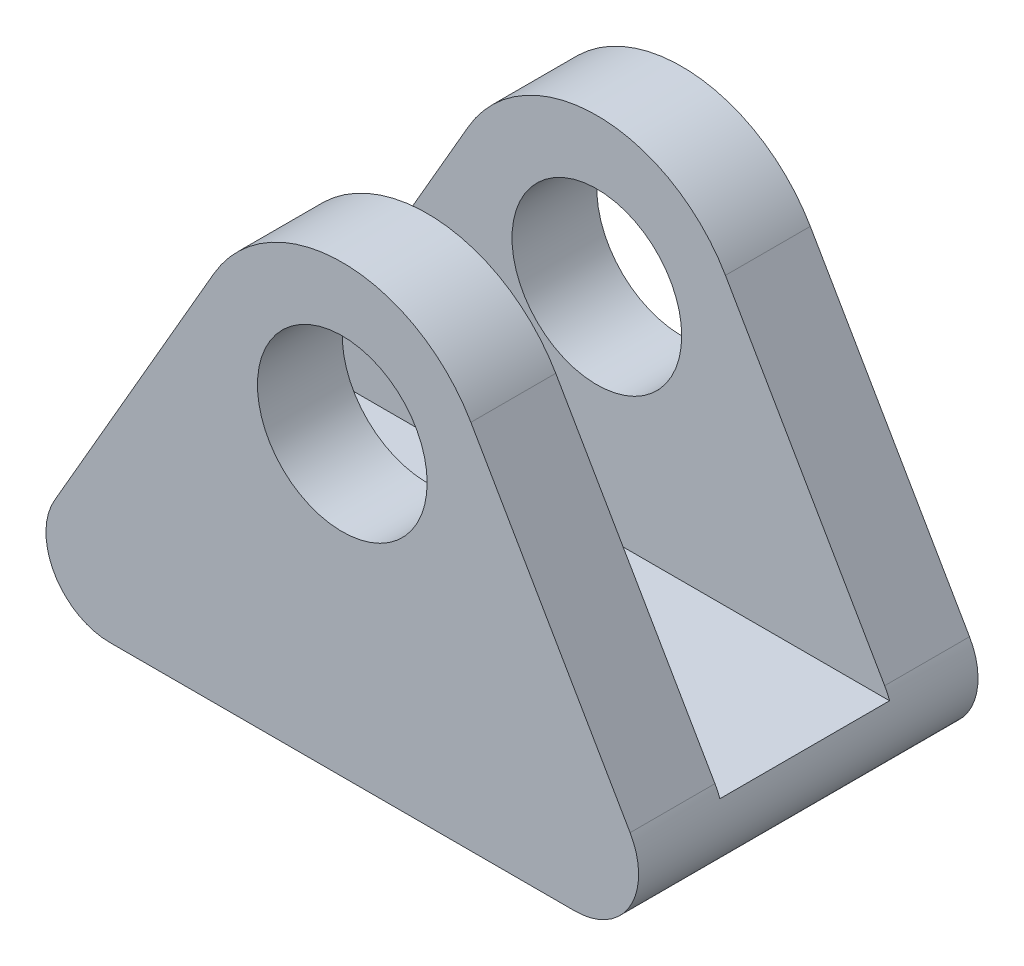
ISO-10303-21;
HEADER;
FILE_DESCRIPTION(('STEP AP214'),'2;1');
FILE_NAME('part.step','',(''),(''),'','','');
FILE_SCHEMA(('AUTOMOTIVE_DESIGN { 1 0 10303 214 1 1 1 1 }'));
ENDSEC;
DATA;
#1=APPLICATION_CONTEXT('core data for automotive mechanical design processes');
#2=APPLICATION_PROTOCOL_DEFINITION('international standard','automotive_design',2000,#1);
#3=PRODUCT_CONTEXT('',#1,'mechanical');
#4=PRODUCT('Part','Part','',(#3));
#5=PRODUCT_RELATED_PRODUCT_CATEGORY('part','',(#4));
#6=PRODUCT_DEFINITION_FORMATION('','',#4);
#7=PRODUCT_DEFINITION_CONTEXT('part definition',#1,'design');
#8=PRODUCT_DEFINITION('design','',#6,#7);
#9=PRODUCT_DEFINITION_SHAPE('','',#8);
#10=(LENGTH_UNIT() NAMED_UNIT(*) SI_UNIT(.MILLI.,.METRE.));
#11=(NAMED_UNIT(*) PLANE_ANGLE_UNIT() SI_UNIT($,.RADIAN.));
#12=(NAMED_UNIT(*) SI_UNIT($,.STERADIAN.) SOLID_ANGLE_UNIT());
#13=UNCERTAINTY_MEASURE_WITH_UNIT(LENGTH_MEASURE(1.E-05),#10,'distance_accuracy_value','');
#14=(GEOMETRIC_REPRESENTATION_CONTEXT(3) GLOBAL_UNCERTAINTY_ASSIGNED_CONTEXT((#13)) GLOBAL_UNIT_ASSIGNED_CONTEXT((#10,
#11,#12)) REPRESENTATION_CONTEXT('',''));
#15=CARTESIAN_POINT('',(0.,0.,0.));
#16=DIRECTION('',(0.,0.,1.));
#17=DIRECTION('',(1.,0.,0.));
#18=AXIS2_PLACEMENT_3D('',#15,#16,#17);
#19=CARTESIAN_POINT('',(16.1658075373096,-14.,4.));
#20=DIRECTION('',(-0.866025403784436,-0.500000000000004,0.));
#21=DIRECTION('',(0.500000000000004,-0.866025403784436,0.));
#22=AXIS2_PLACEMENT_3D('',#19,#20,#21);
#23=PLANE('',#22);
#24=DIRECTION('',(-0.500000000000004,0.866025403784436,0.));
#25=VECTOR('',#24,1.);
#26=CARTESIAN_POINT('',(16.1658075373096,-14.,4.));
#27=LINE('',#26,#25);
#28=CARTESIAN_POINT('',(13.5677313259563,-9.49999999999999,4.));
#29=VERTEX_POINT('',#28);
#30=CARTESIAN_POINT('',(6.06217782649106,3.50000000000003,4.));
#31=VERTEX_POINT('',#30);
#32=EDGE_CURVE('E192',#29,#31,#27,.T.);
#33=ORIENTED_EDGE('',*,*,#32,.F.);
#34=DIRECTION('',(0.,0.,-1.));
#35=VECTOR('',#34,1.);
#36=CARTESIAN_POINT('',(13.5677313259563,-9.49999999999999,4.));
#37=LINE('',#36,#35);
#38=CARTESIAN_POINT('',(13.5677313259563,-9.49999999999999,0.));
#39=VERTEX_POINT('',#38);
#40=EDGE_CURVE('E11',#29,#39,#37,.T.);
#41=ORIENTED_EDGE('',*,*,#40,.T.);
#42=DIRECTION('',(-0.500000000000004,0.866025403784436,0.));
#43=VECTOR('',#42,1.);
#44=CARTESIAN_POINT('',(16.1658075373096,-14.,0.));
#45=LINE('',#44,#43);
#46=CARTESIAN_POINT('',(6.06217782649106,3.50000000000003,0.));
#47=VERTEX_POINT('',#46);
#48=EDGE_CURVE('E187',#39,#47,#45,.T.);
#49=ORIENTED_EDGE('',*,*,#48,.T.);
#50=DIRECTION('',(0.,0.,-1.));
#51=VECTOR('',#50,1.);
#52=CARTESIAN_POINT('',(6.06217782649106,3.50000000000003,4.));
#53=LINE('',#52,#51);
#54=EDGE_CURVE('E194',#31,#47,#53,.T.);
#55=ORIENTED_EDGE('',*,*,#54,.F.);
#56=EDGE_LOOP('',(#33,#41,#49,#55));
#57=FACE_BOUND('',#56,.T.);
#58=ADVANCED_FACE('F39',(#57),#23,.F.);
#59=CARTESIAN_POINT('',(-6.06217782649105,3.50000000000003,4.));
#60=DIRECTION('',(0.866025403784436,-0.500000000000004,0.));
#61=DIRECTION('',(0.500000000000004,0.866025403784436,0.));
#62=AXIS2_PLACEMENT_3D('',#59,#60,#61);
#63=PLANE('',#62);
#64=DIRECTION('',(-0.500000000000004,-0.866025403784436,0.));
#65=VECTOR('',#64,1.);
#66=CARTESIAN_POINT('',(-6.06217782649105,3.50000000000003,-12.));
#67=LINE('',#66,#65);
#68=CARTESIAN_POINT('',(-6.06217782649105,3.50000000000003,-12.));
#69=VERTEX_POINT('',#68);
#70=CARTESIAN_POINT('',(-13.5677313259563,-9.49999999999998,-12.));
#71=VERTEX_POINT('',#70);
#72=EDGE_CURVE('E154',#69,#71,#67,.T.);
#73=ORIENTED_EDGE('',*,*,#72,.T.);
#74=DIRECTION('',(0.,0.,-1.));
#75=VECTOR('',#74,1.);
#76=CARTESIAN_POINT('',(-13.5677313259563,-9.49999999999998,4.));
#77=LINE('',#76,#75);
#78=CARTESIAN_POINT('',(-13.5677313259563,-9.49999999999998,-8.));
#79=VERTEX_POINT('',#78);
#80=EDGE_CURVE('E217',#71,#79,#77,.F.);
#81=ORIENTED_EDGE('',*,*,#80,.T.);
#82=DIRECTION('',(-0.500000000000004,-0.866025403784436,0.));
#83=VECTOR('',#82,1.);
#84=CARTESIAN_POINT('',(-6.06217782649105,3.50000000000003,-8.));
#85=LINE('',#84,#83);
#86=CARTESIAN_POINT('',(-6.06217782649105,3.50000000000003,-8.));
#87=VERTEX_POINT('',#86);
#88=EDGE_CURVE('E155',#87,#79,#85,.T.);
#89=ORIENTED_EDGE('',*,*,#88,.F.);
#90=DIRECTION('',(0.,0.,1.));
#91=VECTOR('',#90,1.);
#92=CARTESIAN_POINT('',(-6.06217782649105,3.50000000000003,-12.));
#93=LINE('',#92,#91);
#94=EDGE_CURVE('E149',#69,#87,#93,.T.);
#95=ORIENTED_EDGE('',*,*,#94,.F.);
#96=EDGE_LOOP('',(#73,#81,#89,#95));
#97=FACE_BOUND('',#96,.T.);
#98=ADVANCED_FACE('F246',(#97),#63,.F.);
#99=CARTESIAN_POINT('',(0.,0.,0.));
#100=DIRECTION('',(0.,0.,1.));
#101=DIRECTION('',(1.,0.,0.));
#102=AXIS2_PLACEMENT_3D('',#99,#100,#101);
#103=PLANE('',#102);
#104=CARTESIAN_POINT('',(0.,0.,0.));
#105=DIRECTION('',(0.,0.,1.));
#106=DIRECTION('',(1.,0.,0.));
#107=AXIS2_PLACEMENT_3D('',#104,#105,#106);
#108=CIRCLE('',#107,4.);
#109=CARTESIAN_POINT('',(4.,0.,0.));
#110=VERTEX_POINT('',#109);
#111=EDGE_CURVE('E174',#110,#110,#108,.T.);
#112=ORIENTED_EDGE('',*,*,#111,.T.);
#113=EDGE_LOOP('',(#112));
#114=FACE_BOUND('',#113,.T.);
#115=DIRECTION('',(1.,0.,0.));
#116=VECTOR('',#115,1.);
#117=CARTESIAN_POINT('',(13.8564064605511,-10.,0.));
#118=LINE('',#117,#116);
#119=CARTESIAN_POINT('',(-13.7980822393492,-10.,0.));
#120=VERTEX_POINT('',#119);
#121=CARTESIAN_POINT('',(13.7980822393492,-10.,0.));
#122=VERTEX_POINT('',#121);
#123=EDGE_CURVE('E148',#120,#122,#118,.T.);
#124=ORIENTED_EDGE('',*,*,#123,.F.);
#125=CARTESIAN_POINT('',(-10.969655114603,-11.,0.));
#126=DIRECTION('',(0.,0.,1.));
#127=DIRECTION('',(1.,0.,0.));
#128=AXIS2_PLACEMENT_3D('',#125,#126,#127);
#129=CIRCLE('',#128,3.);
#130=CARTESIAN_POINT('',(-13.5677313259563,-9.49999999999998,0.));
#131=VERTEX_POINT('',#130);
#132=EDGE_CURVE('E228',#120,#131,#129,.F.);
#133=ORIENTED_EDGE('',*,*,#132,.T.);
#134=DIRECTION('',(-0.500000000000004,-0.866025403784436,0.));
#135=VECTOR('',#134,1.);
#136=CARTESIAN_POINT('',(-6.06217782649105,3.50000000000003,0.));
#137=LINE('',#136,#135);
#138=CARTESIAN_POINT('',(-6.06217782649105,3.50000000000003,0.));
#139=VERTEX_POINT('',#138);
#140=EDGE_CURVE('E197',#139,#131,#137,.T.);
#141=ORIENTED_EDGE('',*,*,#140,.F.);
#142=CARTESIAN_POINT('',(0.,0.,0.));
#143=DIRECTION('',(0.,0.,1.));
#144=DIRECTION('',(1.,0.,0.));
#145=AXIS2_PLACEMENT_3D('',#142,#143,#144);
#146=CIRCLE('',#145,7.);
#147=EDGE_CURVE('E180',#47,#139,#146,.T.);
#148=ORIENTED_EDGE('',*,*,#147,.F.);
#149=ORIENTED_EDGE('',*,*,#48,.F.);
#150=CARTESIAN_POINT('',(10.969655114603,-11.,0.));
#151=DIRECTION('',(0.,0.,1.));
#152=DIRECTION('',(1.,0.,0.));
#153=AXIS2_PLACEMENT_3D('',#150,#151,#152);
#154=CIRCLE('',#153,3.);
#155=EDGE_CURVE('E62',#39,#122,#154,.F.);
#156=ORIENTED_EDGE('',*,*,#155,.T.);
#157=EDGE_LOOP('',(#124,#133,#141,#148,#149,#156));
#158=FACE_BOUND('',#157,.T.);
#159=ADVANCED_FACE('F257',(#114,#158),#103,.F.);
#160=CARTESIAN_POINT('',(0.,0.,4.));
#161=DIRECTION('',(0.,0.,1.));
#162=DIRECTION('',(1.,0.,0.));
#163=AXIS2_PLACEMENT_3D('',#160,#161,#162);
#164=PLANE('',#163);
#165=DIRECTION('',(-0.500000000000004,-0.866025403784436,0.));
#166=VECTOR('',#165,1.);
#167=CARTESIAN_POINT('',(-6.06217782649105,3.50000000000003,4.));
#168=LINE('',#167,#166);
#169=CARTESIAN_POINT('',(-6.06217782649105,3.50000000000003,4.));
#170=VERTEX_POINT('',#169);
#171=CARTESIAN_POINT('',(-13.5677313259563,-9.49999999999998,4.));
#172=VERTEX_POINT('',#171);
#173=EDGE_CURVE('E186',#170,#172,#168,.T.);
#174=ORIENTED_EDGE('',*,*,#173,.T.);
#175=CARTESIAN_POINT('',(-10.969655114603,-11.,4.));
#176=DIRECTION('',(0.,0.,1.));
#177=DIRECTION('',(1.,0.,0.));
#178=AXIS2_PLACEMENT_3D('',#175,#176,#177);
#179=CIRCLE('',#178,3.);
#180=CARTESIAN_POINT('',(-10.969655114603,-14.,4.));
#181=VERTEX_POINT('',#180);
#182=EDGE_CURVE('E231',#172,#181,#179,.T.);
#183=ORIENTED_EDGE('',*,*,#182,.T.);
#184=DIRECTION('',(1.,0.,0.));
#185=VECTOR('',#184,1.);
#186=CARTESIAN_POINT('',(-16.1658075373096,-14.,4.));
#187=LINE('',#186,#185);
#188=CARTESIAN_POINT('',(10.969655114603,-14.,4.));
#189=VERTEX_POINT('',#188);
#190=EDGE_CURVE('E190',#181,#189,#187,.T.);
#191=ORIENTED_EDGE('',*,*,#190,.T.);
#192=CARTESIAN_POINT('',(10.969655114603,-11.,4.));
#193=DIRECTION('',(0.,0.,1.));
#194=DIRECTION('',(1.,0.,0.));
#195=AXIS2_PLACEMENT_3D('',#192,#193,#194);
#196=CIRCLE('',#195,3.);
#197=EDGE_CURVE('E54',#189,#29,#196,.T.);
#198=ORIENTED_EDGE('',*,*,#197,.T.);
#199=ORIENTED_EDGE('',*,*,#32,.T.);
#200=CARTESIAN_POINT('',(0.,0.,4.));
#201=DIRECTION('',(0.,0.,1.));
#202=DIRECTION('',(1.,0.,0.));
#203=AXIS2_PLACEMENT_3D('',#200,#201,#202);
#204=CIRCLE('',#203,7.);
#205=EDGE_CURVE('E183',#31,#170,#204,.T.);
#206=ORIENTED_EDGE('',*,*,#205,.T.);
#207=EDGE_LOOP('',(#174,#183,#191,#198,#199,#206));
#208=FACE_BOUND('',#207,.T.);
#209=CARTESIAN_POINT('',(0.,0.,4.));
#210=DIRECTION('',(0.,0.,1.));
#211=DIRECTION('',(1.,0.,0.));
#212=AXIS2_PLACEMENT_3D('',#209,#210,#211);
#213=CIRCLE('',#212,4.);
#214=CARTESIAN_POINT('',(4.,0.,4.));
#215=VERTEX_POINT('',#214);
#216=EDGE_CURVE('E177',#215,#215,#213,.T.);
#217=ORIENTED_EDGE('',*,*,#216,.F.);
#218=EDGE_LOOP('',(#217));
#219=FACE_BOUND('',#218,.T.);
#220=ADVANCED_FACE('F234',(#208,#219),#164,.T.);
#221=CARTESIAN_POINT('',(0.,0.,4.));
#222=DIRECTION('',(0.,0.,-1.));
#223=DIRECTION('',(-1.,0.,0.));
#224=AXIS2_PLACEMENT_3D('',#221,#222,#223);
#225=CYLINDRICAL_SURFACE('',#224,7.);
#226=ORIENTED_EDGE('',*,*,#147,.T.);
#227=DIRECTION('',(0.,0.,-1.));
#228=VECTOR('',#227,1.);
#229=CARTESIAN_POINT('',(-6.06217782649105,3.50000000000003,4.));
#230=LINE('',#229,#228);
#231=EDGE_CURVE('E203',#170,#139,#230,.T.);
#232=ORIENTED_EDGE('',*,*,#231,.F.);
#233=ORIENTED_EDGE('',*,*,#205,.F.);
#234=ORIENTED_EDGE('',*,*,#54,.T.);
#235=EDGE_LOOP('',(#226,#232,#233,#234));
#236=FACE_BOUND('',#235,.T.);
#237=ADVANCED_FACE('F260',(#236),#225,.T.);
#238=ORIENTED_EDGE('',*,*,#140,.T.);
#239=DIRECTION('',(0.,0.,-1.));
#240=VECTOR('',#239,1.);
#241=CARTESIAN_POINT('',(-13.5677313259563,-9.49999999999998,4.));
#242=LINE('',#241,#240);
#243=EDGE_CURVE('E215',#131,#172,#242,.F.);
#244=ORIENTED_EDGE('',*,*,#243,.T.);
#245=ORIENTED_EDGE('',*,*,#173,.F.);
#246=ORIENTED_EDGE('',*,*,#231,.T.);
#247=EDGE_LOOP('',(#238,#244,#245,#246));
#248=FACE_BOUND('',#247,.T.);
#249=ADVANCED_FACE('F263',(#248),#63,.F.);
#250=CARTESIAN_POINT('',(-16.1658075373096,-14.,4.));
#251=DIRECTION('',(0.,1.,0.));
#252=DIRECTION('',(-1.,0.,0.));
#253=AXIS2_PLACEMENT_3D('',#250,#251,#252);
#254=PLANE('',#253);
#255=ORIENTED_EDGE('',*,*,#190,.F.);
#256=DIRECTION('',(0.,0.,-1.));
#257=VECTOR('',#256,1.);
#258=CARTESIAN_POINT('',(-10.969655114603,-14.,4.));
#259=LINE('',#258,#257);
#260=CARTESIAN_POINT('',(-10.969655114603,-14.,-12.));
#261=VERTEX_POINT('',#260);
#262=EDGE_CURVE('E208',#181,#261,#259,.T.);
#263=ORIENTED_EDGE('',*,*,#262,.T.);
#264=DIRECTION('',(1.,0.,0.));
#265=VECTOR('',#264,1.);
#266=CARTESIAN_POINT('',(-16.1658075373096,-14.,-12.));
#267=LINE('',#266,#265);
#268=CARTESIAN_POINT('',(10.969655114603,-14.,-12.));
#269=VERTEX_POINT('',#268);
#270=EDGE_CURVE('E139',#261,#269,#267,.T.);
#271=ORIENTED_EDGE('',*,*,#270,.T.);
#272=DIRECTION('',(0.,0.,-1.));
#273=VECTOR('',#272,1.);
#274=CARTESIAN_POINT('',(10.969655114603,-14.,4.));
#275=LINE('',#274,#273);
#276=EDGE_CURVE('E206',#269,#189,#275,.F.);
#277=ORIENTED_EDGE('',*,*,#276,.T.);
#278=EDGE_LOOP('',(#255,#263,#271,#277));
#279=FACE_BOUND('',#278,.T.);
#280=ADVANCED_FACE('F240',(#279),#254,.F.);
#281=DIRECTION('',(-0.500000000000004,0.866025403784436,0.));
#282=VECTOR('',#281,1.);
#283=CARTESIAN_POINT('',(16.1658075373096,-14.,-8.));
#284=LINE('',#283,#282);
#285=CARTESIAN_POINT('',(13.5677313259563,-9.49999999999999,-8.));
#286=VERTEX_POINT('',#285);
#287=CARTESIAN_POINT('',(6.06217782649106,3.50000000000003,-8.));
#288=VERTEX_POINT('',#287);
#289=EDGE_CURVE('E158',#286,#288,#284,.T.);
#290=ORIENTED_EDGE('',*,*,#289,.F.);
#291=DIRECTION('',(0.,0.,-1.));
#292=VECTOR('',#291,1.);
#293=CARTESIAN_POINT('',(13.5677313259563,-9.49999999999999,4.));
#294=LINE('',#293,#292);
#295=CARTESIAN_POINT('',(13.5677313259563,-9.49999999999999,-12.));
#296=VERTEX_POINT('',#295);
#297=EDGE_CURVE('E47',#286,#296,#294,.T.);
#298=ORIENTED_EDGE('',*,*,#297,.T.);
#299=DIRECTION('',(-0.500000000000004,0.866025403784436,0.));
#300=VECTOR('',#299,1.);
#301=CARTESIAN_POINT('',(16.1658075373096,-14.,-12.));
#302=LINE('',#301,#300);
#303=CARTESIAN_POINT('',(6.06217782649106,3.50000000000003,-12.));
#304=VERTEX_POINT('',#303);
#305=EDGE_CURVE('E129',#296,#304,#302,.T.);
#306=ORIENTED_EDGE('',*,*,#305,.T.);
#307=DIRECTION('',(0.,0.,1.));
#308=VECTOR('',#307,1.);
#309=CARTESIAN_POINT('',(6.06217782649106,3.50000000000003,-12.));
#310=LINE('',#309,#308);
#311=EDGE_CURVE('E133',#304,#288,#310,.T.);
#312=ORIENTED_EDGE('',*,*,#311,.T.);
#313=EDGE_LOOP('',(#290,#298,#306,#312));
#314=FACE_BOUND('',#313,.T.);
#315=ADVANCED_FACE('F132',(#314),#23,.F.);
#316=CARTESIAN_POINT('',(0.,0.,4.));
#317=DIRECTION('',(0.,0.,-1.));
#318=DIRECTION('',(-1.,0.,0.));
#319=AXIS2_PLACEMENT_3D('',#316,#317,#318);
#320=CYLINDRICAL_SURFACE('',#319,4.);
#321=ORIENTED_EDGE('',*,*,#216,.T.);
#322=EDGE_LOOP('',(#321));
#323=FACE_BOUND('',#322,.T.);
#324=ORIENTED_EDGE('',*,*,#111,.F.);
#325=EDGE_LOOP('',(#324));
#326=FACE_BOUND('',#325,.T.);
#327=ADVANCED_FACE('F270',(#323,#326),#320,.F.);
#328=CARTESIAN_POINT('',(13.8564064605511,-10.,-8.));
#329=DIRECTION('',(0.,-1.,0.));
#330=DIRECTION('',(0.,0.,-1.));
#331=AXIS2_PLACEMENT_3D('',#328,#329,#330);
#332=PLANE('',#331);
#333=DIRECTION('',(1.,0.,0.));
#334=VECTOR('',#333,1.);
#335=CARTESIAN_POINT('',(13.8564064605511,-10.,-8.));
#336=LINE('',#335,#334);
#337=CARTESIAN_POINT('',(-13.7980822393492,-10.,-8.));
#338=VERTEX_POINT('',#337);
#339=CARTESIAN_POINT('',(13.7980822393492,-10.,-8.));
#340=VERTEX_POINT('',#339);
#341=EDGE_CURVE('E171',#338,#340,#336,.T.);
#342=ORIENTED_EDGE('',*,*,#341,.F.);
#343=DIRECTION('',(0.,0.,-1.));
#344=VECTOR('',#343,1.);
#345=CARTESIAN_POINT('',(-13.7980822393492,-10.,-8.));
#346=LINE('',#345,#344);
#347=EDGE_CURVE('E225',#338,#120,#346,.F.);
#348=ORIENTED_EDGE('',*,*,#347,.T.);
#349=ORIENTED_EDGE('',*,*,#123,.T.);
#350=DIRECTION('',(0.,0.,-1.));
#351=VECTOR('',#350,1.);
#352=CARTESIAN_POINT('',(13.7980822393492,-10.,0.));
#353=LINE('',#352,#351);
#354=EDGE_CURVE('E223',#122,#340,#353,.T.);
#355=ORIENTED_EDGE('',*,*,#354,.T.);
#356=EDGE_LOOP('',(#342,#348,#349,#355));
#357=FACE_BOUND('',#356,.T.);
#358=ADVANCED_FACE('F268',(#357),#332,.F.);
#359=CARTESIAN_POINT('',(0.,0.,-8.));
#360=DIRECTION('',(0.,0.,-1.));
#361=DIRECTION('',(1.,0.,0.));
#362=AXIS2_PLACEMENT_3D('',#359,#360,#361);
#363=PLANE('',#362);
#364=CARTESIAN_POINT('',(0.,0.,-8.));
#365=DIRECTION('',(0.,0.,1.));
#366=DIRECTION('',(1.,0.,0.));
#367=AXIS2_PLACEMENT_3D('',#364,#365,#366);
#368=CIRCLE('',#367,4.);
#369=CARTESIAN_POINT('',(4.,0.,-8.));
#370=VERTEX_POINT('',#369);
#371=EDGE_CURVE('E161',#370,#370,#368,.T.);
#372=ORIENTED_EDGE('',*,*,#371,.F.);
#373=EDGE_LOOP('',(#372));
#374=FACE_BOUND('',#373,.T.);
#375=ORIENTED_EDGE('',*,*,#88,.T.);
#376=CARTESIAN_POINT('',(-10.969655114603,-11.,-8.));
#377=DIRECTION('',(0.,0.,-1.));
#378=DIRECTION('',(-1.,0.,0.));
#379=AXIS2_PLACEMENT_3D('',#376,#377,#378);
#380=CIRCLE('',#379,3.);
#381=EDGE_CURVE('E221',#79,#338,#380,.F.);
#382=ORIENTED_EDGE('',*,*,#381,.T.);
#383=ORIENTED_EDGE('',*,*,#341,.T.);
#384=CARTESIAN_POINT('',(10.969655114603,-11.,-8.));
#385=DIRECTION('',(0.,0.,-1.));
#386=DIRECTION('',(-1.,0.,0.));
#387=AXIS2_PLACEMENT_3D('',#384,#385,#386);
#388=CIRCLE('',#387,3.);
#389=EDGE_CURVE('E219',#340,#286,#388,.F.);
#390=ORIENTED_EDGE('',*,*,#389,.T.);
#391=ORIENTED_EDGE('',*,*,#289,.T.);
#392=CARTESIAN_POINT('',(0.,0.,-8.));
#393=DIRECTION('',(0.,0.,1.));
#394=DIRECTION('',(1.,0.,0.));
#395=AXIS2_PLACEMENT_3D('',#392,#393,#394);
#396=CIRCLE('',#395,7.);
#397=EDGE_CURVE('E147',#288,#87,#396,.T.);
#398=ORIENTED_EDGE('',*,*,#397,.T.);
#399=EDGE_LOOP('',(#375,#382,#383,#390,#391,#398));
#400=FACE_BOUND('',#399,.T.);
#401=ADVANCED_FACE('F249',(#374,#400),#363,.F.);
#402=CARTESIAN_POINT('',(0.,0.,-12.));
#403=DIRECTION('',(0.,0.,1.));
#404=DIRECTION('',(1.,0.,0.));
#405=AXIS2_PLACEMENT_3D('',#402,#403,#404);
#406=CYLINDRICAL_SURFACE('',#405,7.);
#407=ORIENTED_EDGE('',*,*,#397,.F.);
#408=ORIENTED_EDGE('',*,*,#311,.F.);
#409=CARTESIAN_POINT('',(0.,0.,-12.));
#410=DIRECTION('',(0.,0.,1.));
#411=DIRECTION('',(1.,0.,0.));
#412=AXIS2_PLACEMENT_3D('',#409,#410,#411);
#413=CIRCLE('',#412,7.);
#414=EDGE_CURVE('E140',#304,#69,#413,.T.);
#415=ORIENTED_EDGE('',*,*,#414,.T.);
#416=ORIENTED_EDGE('',*,*,#94,.T.);
#417=EDGE_LOOP('',(#407,#408,#415,#416));
#418=FACE_BOUND('',#417,.T.);
#419=ADVANCED_FACE('F144',(#418),#406,.T.);
#420=CARTESIAN_POINT('',(0.,0.,-12.));
#421=DIRECTION('',(0.,0.,-1.));
#422=DIRECTION('',(1.,0.,0.));
#423=AXIS2_PLACEMENT_3D('',#420,#421,#422);
#424=PLANE('',#423);
#425=CARTESIAN_POINT('',(0.,0.,-12.));
#426=DIRECTION('',(0.,0.,1.));
#427=DIRECTION('',(1.,0.,0.));
#428=AXIS2_PLACEMENT_3D('',#425,#426,#427);
#429=CIRCLE('',#428,4.);
#430=CARTESIAN_POINT('',(4.,0.,-12.));
#431=VERTEX_POINT('',#430);
#432=EDGE_CURVE('E168',#431,#431,#429,.T.);
#433=ORIENTED_EDGE('',*,*,#432,.T.);
#434=EDGE_LOOP('',(#433));
#435=FACE_BOUND('',#434,.T.);
#436=ORIENTED_EDGE('',*,*,#270,.F.);
#437=CARTESIAN_POINT('',(-10.969655114603,-11.,-12.));
#438=DIRECTION('',(0.,0.,-1.));
#439=DIRECTION('',(-1.,0.,0.));
#440=AXIS2_PLACEMENT_3D('',#437,#438,#439);
#441=CIRCLE('',#440,3.);
#442=EDGE_CURVE('E213',#261,#71,#441,.T.);
#443=ORIENTED_EDGE('',*,*,#442,.T.);
#444=ORIENTED_EDGE('',*,*,#72,.F.);
#445=ORIENTED_EDGE('',*,*,#414,.F.);
#446=ORIENTED_EDGE('',*,*,#305,.F.);
#447=CARTESIAN_POINT('',(10.969655114603,-11.,-12.));
#448=DIRECTION('',(0.,0.,-1.));
#449=DIRECTION('',(-1.,0.,0.));
#450=AXIS2_PLACEMENT_3D('',#447,#448,#449);
#451=CIRCLE('',#450,3.);
#452=EDGE_CURVE('E211',#296,#269,#451,.T.);
#453=ORIENTED_EDGE('',*,*,#452,.T.);
#454=EDGE_LOOP('',(#436,#443,#444,#445,#446,#453));
#455=FACE_BOUND('',#454,.T.);
#456=ADVANCED_FACE('F152',(#435,#455),#424,.T.);
#457=CARTESIAN_POINT('',(0.,0.,-12.));
#458=DIRECTION('',(0.,0.,1.));
#459=DIRECTION('',(1.,0.,0.));
#460=AXIS2_PLACEMENT_3D('',#457,#458,#459);
#461=CYLINDRICAL_SURFACE('',#460,4.);
#462=ORIENTED_EDGE('',*,*,#432,.F.);
#463=EDGE_LOOP('',(#462));
#464=FACE_BOUND('',#463,.T.);
#465=ORIENTED_EDGE('',*,*,#371,.T.);
#466=EDGE_LOOP('',(#465));
#467=FACE_BOUND('',#466,.T.);
#468=ADVANCED_FACE('F299',(#464,#467),#461,.F.);
#469=CARTESIAN_POINT('',(-10.969655114603,-11.,4.));
#470=DIRECTION('',(0.,0.,-1.));
#471=DIRECTION('',(-1.,0.,0.));
#472=AXIS2_PLACEMENT_3D('',#469,#470,#471);
#473=CYLINDRICAL_SURFACE('',#472,3.);
#474=ORIENTED_EDGE('',*,*,#381,.F.);
#475=ORIENTED_EDGE('',*,*,#80,.F.);
#476=ORIENTED_EDGE('',*,*,#442,.F.);
#477=ORIENTED_EDGE('',*,*,#262,.F.);
#478=ORIENTED_EDGE('',*,*,#182,.F.);
#479=ORIENTED_EDGE('',*,*,#243,.F.);
#480=ORIENTED_EDGE('',*,*,#132,.F.);
#481=ORIENTED_EDGE('',*,*,#347,.F.);
#482=EDGE_LOOP('',(#474,#475,#476,#477,#478,#479,#480,#481));
#483=FACE_BOUND('',#482,.T.);
#484=ADVANCED_FACE('F243',(#483),#473,.T.);
#485=CARTESIAN_POINT('',(10.969655114603,-11.,4.));
#486=DIRECTION('',(0.,0.,-1.));
#487=DIRECTION('',(-1.,0.,0.));
#488=AXIS2_PLACEMENT_3D('',#485,#486,#487);
#489=CYLINDRICAL_SURFACE('',#488,3.);
#490=ORIENTED_EDGE('',*,*,#197,.F.);
#491=ORIENTED_EDGE('',*,*,#276,.F.);
#492=ORIENTED_EDGE('',*,*,#452,.F.);
#493=ORIENTED_EDGE('',*,*,#297,.F.);
#494=ORIENTED_EDGE('',*,*,#389,.F.);
#495=ORIENTED_EDGE('',*,*,#354,.F.);
#496=ORIENTED_EDGE('',*,*,#155,.F.);
#497=ORIENTED_EDGE('',*,*,#40,.F.);
#498=EDGE_LOOP('',(#490,#491,#492,#493,#494,#495,#496,#497));
#499=FACE_BOUND('',#498,.T.);
#500=ADVANCED_FACE('F41',(#499),#489,.T.);
#501=CLOSED_SHELL('',(#58,#98,#159,#220,#237,#249,#280,#315,#327,#358,#401,#419,#456,#468,#484,#500));
#502=MANIFOLD_SOLID_BREP('B2',#501);
#503=ADVANCED_BREP_SHAPE_REPRESENTATION('',(#18,#502),#14);
#504=SHAPE_DEFINITION_REPRESENTATION(#9,#503);
ENDSEC;
END-ISO-10303-21;
